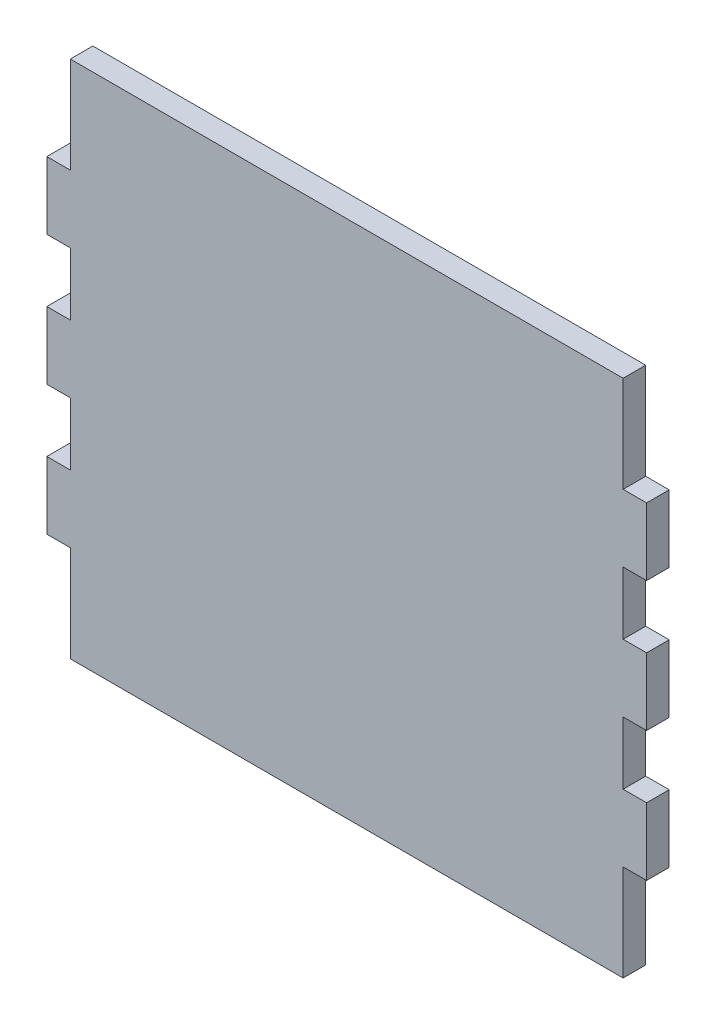
ISO-10303-21;
HEADER;
FILE_DESCRIPTION(('STEP AP214'),'2;1');
FILE_NAME('part.step','',(''),(''),'','','');
FILE_SCHEMA(('AUTOMOTIVE_DESIGN { 1 0 10303 214 1 1 1 1 }'));
ENDSEC;
DATA;
#1=APPLICATION_CONTEXT('core data for automotive mechanical design processes');
#2=APPLICATION_PROTOCOL_DEFINITION('international standard','automotive_design',2000,#1);
#3=PRODUCT_CONTEXT('',#1,'mechanical');
#4=PRODUCT('Part','Part','',(#3));
#5=PRODUCT_RELATED_PRODUCT_CATEGORY('part','',(#4));
#6=PRODUCT_DEFINITION_FORMATION('','',#4);
#7=PRODUCT_DEFINITION_CONTEXT('part definition',#1,'design');
#8=PRODUCT_DEFINITION('design','',#6,#7);
#9=PRODUCT_DEFINITION_SHAPE('','',#8);
#10=(LENGTH_UNIT() NAMED_UNIT(*) SI_UNIT(.MILLI.,.METRE.));
#11=(NAMED_UNIT(*) PLANE_ANGLE_UNIT() SI_UNIT($,.RADIAN.));
#12=(NAMED_UNIT(*) SI_UNIT($,.STERADIAN.) SOLID_ANGLE_UNIT());
#13=UNCERTAINTY_MEASURE_WITH_UNIT(LENGTH_MEASURE(1.E-05),#10,'distance_accuracy_value','');
#14=(GEOMETRIC_REPRESENTATION_CONTEXT(3) GLOBAL_UNCERTAINTY_ASSIGNED_CONTEXT((#13)) GLOBAL_UNIT_ASSIGNED_CONTEXT((#10,
#11,#12)) REPRESENTATION_CONTEXT('',''));
#15=CARTESIAN_POINT('',(0.,0.,0.));
#16=DIRECTION('',(0.,0.,1.));
#17=DIRECTION('',(1.,0.,0.));
#18=AXIS2_PLACEMENT_3D('',#15,#16,#17);
#19=CARTESIAN_POINT('',(-77.724,-45.974,3.175));
#20=DIRECTION('',(1.,0.,0.));
#21=DIRECTION('',(0.,0.,-1.));
#22=AXIS2_PLACEMENT_3D('',#19,#20,#21);
#23=PLANE('',#22);
#24=DIRECTION('',(0.,-1.,0.));
#25=VECTOR('',#24,1.);
#26=CARTESIAN_POINT('',(-77.724,-45.974,-3.175));
#27=LINE('',#26,#25);
#28=CARTESIAN_POINT('',(-77.724,-45.974,-3.175));
#29=VERTEX_POINT('',#28);
#30=CARTESIAN_POINT('',(-77.724,-73.025,-3.175));
#31=VERTEX_POINT('',#30);
#32=EDGE_CURVE('E248',#29,#31,#27,.T.);
#33=ORIENTED_EDGE('',*,*,#32,.T.);
#34=DIRECTION('',(0.,0.,-1.));
#35=VECTOR('',#34,1.);
#36=CARTESIAN_POINT('',(-77.724,-73.025,3.175));
#37=LINE('',#36,#35);
#38=CARTESIAN_POINT('',(-77.724,-73.025,3.175));
#39=VERTEX_POINT('',#38);
#40=EDGE_CURVE('E11',#39,#31,#37,.T.);
#41=ORIENTED_EDGE('',*,*,#40,.F.);
#42=DIRECTION('',(0.,-1.,0.));
#43=VECTOR('',#42,1.);
#44=CARTESIAN_POINT('',(-77.724,-45.974,3.175));
#45=LINE('',#44,#43);
#46=CARTESIAN_POINT('',(-77.724,-45.974,3.175));
#47=VERTEX_POINT('',#46);
#48=EDGE_CURVE('E302',#47,#39,#45,.T.);
#49=ORIENTED_EDGE('',*,*,#48,.F.);
#50=DIRECTION('',(0.,0.,-1.));
#51=VECTOR('',#50,1.);
#52=CARTESIAN_POINT('',(-77.724,-45.974,3.175));
#53=LINE('',#52,#51);
#54=EDGE_CURVE('E244',#47,#29,#53,.T.);
#55=ORIENTED_EDGE('',*,*,#54,.T.);
#56=EDGE_LOOP('',(#33,#41,#49,#55));
#57=FACE_BOUND('',#56,.T.);
#58=ADVANCED_FACE('F32',(#57),#23,.F.);
#59=CARTESIAN_POINT('',(77.724,-73.025,3.175));
#60=DIRECTION('',(0.,1.,0.));
#61=DIRECTION('',(0.,0.,1.));
#62=AXIS2_PLACEMENT_3D('',#59,#60,#61);
#63=PLANE('',#62);
#64=DIRECTION('',(1.,0.,0.));
#65=VECTOR('',#64,1.);
#66=CARTESIAN_POINT('',(77.724,-73.025,-3.175));
#67=LINE('',#66,#65);
#68=CARTESIAN_POINT('',(77.724,-73.025,-3.175));
#69=VERTEX_POINT('',#68);
#70=EDGE_CURVE('E251',#31,#69,#67,.T.);
#71=ORIENTED_EDGE('',*,*,#70,.T.);
#72=DIRECTION('',(0.,0.,-1.));
#73=VECTOR('',#72,1.);
#74=CARTESIAN_POINT('',(77.724,-73.025,3.175));
#75=LINE('',#74,#73);
#76=CARTESIAN_POINT('',(77.724,-73.025,3.175));
#77=VERTEX_POINT('',#76);
#78=EDGE_CURVE('E40',#77,#69,#75,.T.);
#79=ORIENTED_EDGE('',*,*,#78,.F.);
#80=DIRECTION('',(1.,0.,0.));
#81=VECTOR('',#80,1.);
#82=CARTESIAN_POINT('',(77.724,-73.025,3.175));
#83=LINE('',#82,#81);
#84=EDGE_CURVE('E151',#39,#77,#83,.T.);
#85=ORIENTED_EDGE('',*,*,#84,.F.);
#86=ORIENTED_EDGE('',*,*,#40,.T.);
#87=EDGE_LOOP('',(#71,#79,#85,#86));
#88=FACE_BOUND('',#87,.T.);
#89=ADVANCED_FACE('F460',(#88),#63,.F.);
#90=CARTESIAN_POINT('',(77.724,-45.974,3.175));
#91=DIRECTION('',(-1.,0.,0.));
#92=DIRECTION('',(0.,0.,1.));
#93=AXIS2_PLACEMENT_3D('',#90,#91,#92);
#94=PLANE('',#93);
#95=DIRECTION('',(0.,1.,0.));
#96=VECTOR('',#95,1.);
#97=CARTESIAN_POINT('',(77.724,-45.974,-3.175));
#98=LINE('',#97,#96);
#99=CARTESIAN_POINT('',(77.724,-45.974,-3.175));
#100=VERTEX_POINT('',#99);
#101=EDGE_CURVE('E253',#69,#100,#98,.T.);
#102=ORIENTED_EDGE('',*,*,#101,.T.);
#103=DIRECTION('',(0.,0.,-1.));
#104=VECTOR('',#103,1.);
#105=CARTESIAN_POINT('',(77.724,-45.974,3.175));
#106=LINE('',#105,#104);
#107=CARTESIAN_POINT('',(77.724,-45.974,3.175));
#108=VERTEX_POINT('',#107);
#109=EDGE_CURVE('E369',#108,#100,#106,.T.);
#110=ORIENTED_EDGE('',*,*,#109,.F.);
#111=DIRECTION('',(0.,1.,0.));
#112=VECTOR('',#111,1.);
#113=CARTESIAN_POINT('',(77.724,-45.974,3.175));
#114=LINE('',#113,#112);
#115=EDGE_CURVE('E377',#77,#108,#114,.T.);
#116=ORIENTED_EDGE('',*,*,#115,.F.);
#117=ORIENTED_EDGE('',*,*,#78,.T.);
#118=EDGE_LOOP('',(#102,#110,#116,#117));
#119=FACE_BOUND('',#118,.T.);
#120=ADVANCED_FACE('F375',(#119),#94,.F.);
#121=CARTESIAN_POINT('',(77.724,-45.974,3.175));
#122=DIRECTION('',(0.,1.,0.));
#123=DIRECTION('',(-1.,0.,0.));
#124=AXIS2_PLACEMENT_3D('',#121,#122,#123);
#125=PLANE('',#124);
#126=DIRECTION('',(1.,0.,0.));
#127=VECTOR('',#126,1.);
#128=CARTESIAN_POINT('',(77.724,-45.974,-3.175));
#129=LINE('',#128,#127);
#130=CARTESIAN_POINT('',(84.328,-45.974,-3.175));
#131=VERTEX_POINT('',#130);
#132=EDGE_CURVE('E255',#100,#131,#129,.T.);
#133=ORIENTED_EDGE('',*,*,#132,.T.);
#134=DIRECTION('',(0.,0.,-1.));
#135=VECTOR('',#134,1.);
#136=CARTESIAN_POINT('',(84.328,-45.974,3.175));
#137=LINE('',#136,#135);
#138=CARTESIAN_POINT('',(84.328,-45.974,3.175));
#139=VERTEX_POINT('',#138);
#140=EDGE_CURVE('E366',#139,#131,#137,.T.);
#141=ORIENTED_EDGE('',*,*,#140,.F.);
#142=DIRECTION('',(1.,0.,0.));
#143=VECTOR('',#142,1.);
#144=CARTESIAN_POINT('',(77.724,-45.974,3.175));
#145=LINE('',#144,#143);
#146=EDGE_CURVE('E395',#108,#139,#145,.T.);
#147=ORIENTED_EDGE('',*,*,#146,.F.);
#148=ORIENTED_EDGE('',*,*,#109,.T.);
#149=EDGE_LOOP('',(#133,#141,#147,#148));
#150=FACE_BOUND('',#149,.T.);
#151=ADVANCED_FACE('F386',(#150),#125,.F.);
#152=CARTESIAN_POINT('',(84.328,-27.051,3.175));
#153=DIRECTION('',(-1.,0.,0.));
#154=DIRECTION('',(0.,0.,1.));
#155=AXIS2_PLACEMENT_3D('',#152,#153,#154);
#156=PLANE('',#155);
#157=DIRECTION('',(0.,1.,0.));
#158=VECTOR('',#157,1.);
#159=CARTESIAN_POINT('',(84.328,-27.051,-3.175));
#160=LINE('',#159,#158);
#161=CARTESIAN_POINT('',(84.328,-27.051,-3.175));
#162=VERTEX_POINT('',#161);
#163=EDGE_CURVE('E257',#131,#162,#160,.T.);
#164=ORIENTED_EDGE('',*,*,#163,.T.);
#165=DIRECTION('',(0.,0.,-1.));
#166=VECTOR('',#165,1.);
#167=CARTESIAN_POINT('',(84.328,-27.051,3.175));
#168=LINE('',#167,#166);
#169=CARTESIAN_POINT('',(84.328,-27.051,3.175));
#170=VERTEX_POINT('',#169);
#171=EDGE_CURVE('E363',#170,#162,#168,.T.);
#172=ORIENTED_EDGE('',*,*,#171,.F.);
#173=DIRECTION('',(0.,1.,0.));
#174=VECTOR('',#173,1.);
#175=CARTESIAN_POINT('',(84.328,-27.051,3.175));
#176=LINE('',#175,#174);
#177=EDGE_CURVE('E392',#139,#170,#176,.T.);
#178=ORIENTED_EDGE('',*,*,#177,.F.);
#179=ORIENTED_EDGE('',*,*,#140,.T.);
#180=EDGE_LOOP('',(#164,#172,#178,#179));
#181=FACE_BOUND('',#180,.T.);
#182=ADVANCED_FACE('F390',(#181),#156,.F.);
#183=CARTESIAN_POINT('',(77.724,-27.051,3.175));
#184=DIRECTION('',(0.,-1.,0.));
#185=DIRECTION('',(1.,0.,0.));
#186=AXIS2_PLACEMENT_3D('',#183,#184,#185);
#187=PLANE('',#186);
#188=DIRECTION('',(-1.,0.,0.));
#189=VECTOR('',#188,1.);
#190=CARTESIAN_POINT('',(77.724,-27.051,-3.175));
#191=LINE('',#190,#189);
#192=CARTESIAN_POINT('',(77.724,-27.051,-3.175));
#193=VERTEX_POINT('',#192);
#194=EDGE_CURVE('E259',#162,#193,#191,.T.);
#195=ORIENTED_EDGE('',*,*,#194,.T.);
#196=DIRECTION('',(0.,0.,-1.));
#197=VECTOR('',#196,1.);
#198=CARTESIAN_POINT('',(77.724,-27.051,3.175));
#199=LINE('',#198,#197);
#200=CARTESIAN_POINT('',(77.724,-27.051,3.175));
#201=VERTEX_POINT('',#200);
#202=EDGE_CURVE('E360',#201,#193,#199,.T.);
#203=ORIENTED_EDGE('',*,*,#202,.F.);
#204=DIRECTION('',(-1.,0.,0.));
#205=VECTOR('',#204,1.);
#206=CARTESIAN_POINT('',(77.724,-27.051,3.175));
#207=LINE('',#206,#205);
#208=EDGE_CURVE('E394',#170,#201,#207,.T.);
#209=ORIENTED_EDGE('',*,*,#208,.F.);
#210=ORIENTED_EDGE('',*,*,#171,.T.);
#211=EDGE_LOOP('',(#195,#203,#209,#210));
#212=FACE_BOUND('',#211,.T.);
#213=ADVANCED_FACE('F473',(#212),#187,.F.);
#214=CARTESIAN_POINT('',(77.724,-9.46149999999997,3.175));
#215=DIRECTION('',(-1.,0.,0.));
#216=DIRECTION('',(0.,0.,1.));
#217=AXIS2_PLACEMENT_3D('',#214,#215,#216);
#218=PLANE('',#217);
#219=DIRECTION('',(0.,1.,0.));
#220=VECTOR('',#219,1.);
#221=CARTESIAN_POINT('',(77.724,-9.46149999999997,-3.175));
#222=LINE('',#221,#220);
#223=CARTESIAN_POINT('',(77.724,-9.46149999999997,-3.175));
#224=VERTEX_POINT('',#223);
#225=EDGE_CURVE('E261',#193,#224,#222,.T.);
#226=ORIENTED_EDGE('',*,*,#225,.T.);
#227=DIRECTION('',(0.,0.,-1.));
#228=VECTOR('',#227,1.);
#229=CARTESIAN_POINT('',(77.724,-9.46149999999997,3.175));
#230=LINE('',#229,#228);
#231=CARTESIAN_POINT('',(77.724,-9.46149999999997,3.175));
#232=VERTEX_POINT('',#231);
#233=EDGE_CURVE('E357',#232,#224,#230,.T.);
#234=ORIENTED_EDGE('',*,*,#233,.F.);
#235=DIRECTION('',(0.,1.,0.));
#236=VECTOR('',#235,1.);
#237=CARTESIAN_POINT('',(77.724,-9.46149999999997,3.175));
#238=LINE('',#237,#236);
#239=EDGE_CURVE('E397',#201,#232,#238,.T.);
#240=ORIENTED_EDGE('',*,*,#239,.F.);
#241=ORIENTED_EDGE('',*,*,#202,.T.);
#242=EDGE_LOOP('',(#226,#234,#240,#241));
#243=FACE_BOUND('',#242,.T.);
#244=ADVANCED_FACE('F476',(#243),#218,.F.);
#245=CARTESIAN_POINT('',(77.724,-9.46149999999997,3.175));
#246=DIRECTION('',(0.,1.,0.));
#247=DIRECTION('',(-1.,0.,0.));
#248=AXIS2_PLACEMENT_3D('',#245,#246,#247);
#249=PLANE('',#248);
#250=DIRECTION('',(1.,0.,0.));
#251=VECTOR('',#250,1.);
#252=CARTESIAN_POINT('',(77.724,-9.46149999999997,-3.175));
#253=LINE('',#252,#251);
#254=CARTESIAN_POINT('',(84.328,-9.46149999999997,-3.175));
#255=VERTEX_POINT('',#254);
#256=EDGE_CURVE('E263',#224,#255,#253,.T.);
#257=ORIENTED_EDGE('',*,*,#256,.T.);
#258=DIRECTION('',(0.,0.,-1.));
#259=VECTOR('',#258,1.);
#260=CARTESIAN_POINT('',(84.328,-9.46149999999997,3.175));
#261=LINE('',#260,#259);
#262=CARTESIAN_POINT('',(84.328,-9.46149999999997,3.175));
#263=VERTEX_POINT('',#262);
#264=EDGE_CURVE('E354',#263,#255,#261,.T.);
#265=ORIENTED_EDGE('',*,*,#264,.F.);
#266=DIRECTION('',(1.,0.,0.));
#267=VECTOR('',#266,1.);
#268=CARTESIAN_POINT('',(77.724,-9.46149999999997,3.175));
#269=LINE('',#268,#267);
#270=EDGE_CURVE('E403',#232,#263,#269,.T.);
#271=ORIENTED_EDGE('',*,*,#270,.F.);
#272=ORIENTED_EDGE('',*,*,#233,.T.);
#273=EDGE_LOOP('',(#257,#265,#271,#272));
#274=FACE_BOUND('',#273,.T.);
#275=ADVANCED_FACE('F480',(#274),#249,.F.);
#276=CARTESIAN_POINT('',(84.328,9.46149999999999,3.175));
#277=DIRECTION('',(-1.,0.,0.));
#278=DIRECTION('',(0.,0.,1.));
#279=AXIS2_PLACEMENT_3D('',#276,#277,#278);
#280=PLANE('',#279);
#281=DIRECTION('',(0.,1.,0.));
#282=VECTOR('',#281,1.);
#283=CARTESIAN_POINT('',(84.328,9.46149999999999,-3.175));
#284=LINE('',#283,#282);
#285=CARTESIAN_POINT('',(84.328,9.46149999999999,-3.175));
#286=VERTEX_POINT('',#285);
#287=EDGE_CURVE('E265',#255,#286,#284,.T.);
#288=ORIENTED_EDGE('',*,*,#287,.T.);
#289=DIRECTION('',(0.,0.,-1.));
#290=VECTOR('',#289,1.);
#291=CARTESIAN_POINT('',(84.328,9.46149999999999,3.175));
#292=LINE('',#291,#290);
#293=CARTESIAN_POINT('',(84.328,9.46149999999999,3.175));
#294=VERTEX_POINT('',#293);
#295=EDGE_CURVE('E351',#294,#286,#292,.T.);
#296=ORIENTED_EDGE('',*,*,#295,.F.);
#297=DIRECTION('',(0.,1.,0.));
#298=VECTOR('',#297,1.);
#299=CARTESIAN_POINT('',(84.328,9.46149999999999,3.175));
#300=LINE('',#299,#298);
#301=EDGE_CURVE('E405',#263,#294,#300,.T.);
#302=ORIENTED_EDGE('',*,*,#301,.F.);
#303=ORIENTED_EDGE('',*,*,#264,.T.);
#304=EDGE_LOOP('',(#288,#296,#302,#303));
#305=FACE_BOUND('',#304,.T.);
#306=ADVANCED_FACE('F484',(#305),#280,.F.);
#307=CARTESIAN_POINT('',(77.724,9.46149999999999,3.175));
#308=DIRECTION('',(0.,-1.,0.));
#309=DIRECTION('',(1.,0.,0.));
#310=AXIS2_PLACEMENT_3D('',#307,#308,#309);
#311=PLANE('',#310);
#312=DIRECTION('',(-1.,0.,0.));
#313=VECTOR('',#312,1.);
#314=CARTESIAN_POINT('',(77.724,9.46149999999999,-3.175));
#315=LINE('',#314,#313);
#316=CARTESIAN_POINT('',(77.724,9.46149999999999,-3.175));
#317=VERTEX_POINT('',#316);
#318=EDGE_CURVE('E267',#286,#317,#315,.T.);
#319=ORIENTED_EDGE('',*,*,#318,.T.);
#320=DIRECTION('',(0.,0.,-1.));
#321=VECTOR('',#320,1.);
#322=CARTESIAN_POINT('',(77.724,9.46149999999999,3.175));
#323=LINE('',#322,#321);
#324=CARTESIAN_POINT('',(77.724,9.46149999999999,3.175));
#325=VERTEX_POINT('',#324);
#326=EDGE_CURVE('E348',#325,#317,#323,.T.);
#327=ORIENTED_EDGE('',*,*,#326,.F.);
#328=DIRECTION('',(-1.,0.,0.));
#329=VECTOR('',#328,1.);
#330=CARTESIAN_POINT('',(77.724,9.46149999999999,3.175));
#331=LINE('',#330,#329);
#332=EDGE_CURVE('E407',#294,#325,#331,.T.);
#333=ORIENTED_EDGE('',*,*,#332,.F.);
#334=ORIENTED_EDGE('',*,*,#295,.T.);
#335=EDGE_LOOP('',(#319,#327,#333,#334));
#336=FACE_BOUND('',#335,.T.);
#337=ADVANCED_FACE('F488',(#336),#311,.F.);
#338=CARTESIAN_POINT('',(77.724,27.051,3.175));
#339=DIRECTION('',(-1.,0.,0.));
#340=DIRECTION('',(0.,0.,1.));
#341=AXIS2_PLACEMENT_3D('',#338,#339,#340);
#342=PLANE('',#341);
#343=DIRECTION('',(0.,1.,0.));
#344=VECTOR('',#343,1.);
#345=CARTESIAN_POINT('',(77.724,27.051,-3.175));
#346=LINE('',#345,#344);
#347=CARTESIAN_POINT('',(77.724,27.051,-3.175));
#348=VERTEX_POINT('',#347);
#349=EDGE_CURVE('E269',#317,#348,#346,.T.);
#350=ORIENTED_EDGE('',*,*,#349,.T.);
#351=DIRECTION('',(0.,0.,-1.));
#352=VECTOR('',#351,1.);
#353=CARTESIAN_POINT('',(77.724,27.051,3.175));
#354=LINE('',#353,#352);
#355=CARTESIAN_POINT('',(77.724,27.051,3.175));
#356=VERTEX_POINT('',#355);
#357=EDGE_CURVE('E345',#356,#348,#354,.T.);
#358=ORIENTED_EDGE('',*,*,#357,.F.);
#359=DIRECTION('',(0.,1.,0.));
#360=VECTOR('',#359,1.);
#361=CARTESIAN_POINT('',(77.724,27.051,3.175));
#362=LINE('',#361,#360);
#363=EDGE_CURVE('E409',#325,#356,#362,.T.);
#364=ORIENTED_EDGE('',*,*,#363,.F.);
#365=ORIENTED_EDGE('',*,*,#326,.T.);
#366=EDGE_LOOP('',(#350,#358,#364,#365));
#367=FACE_BOUND('',#366,.T.);
#368=ADVANCED_FACE('F492',(#367),#342,.F.);
#369=CARTESIAN_POINT('',(77.724,27.051,3.175));
#370=DIRECTION('',(0.,1.,0.));
#371=DIRECTION('',(0.,0.,1.));
#372=AXIS2_PLACEMENT_3D('',#369,#370,#371);
#373=PLANE('',#372);
#374=DIRECTION('',(1.,0.,0.));
#375=VECTOR('',#374,1.);
#376=CARTESIAN_POINT('',(77.724,27.051,-3.175));
#377=LINE('',#376,#375);
#378=CARTESIAN_POINT('',(84.328,27.051,-3.175));
#379=VERTEX_POINT('',#378);
#380=EDGE_CURVE('E271',#348,#379,#377,.T.);
#381=ORIENTED_EDGE('',*,*,#380,.T.);
#382=DIRECTION('',(0.,0.,-1.));
#383=VECTOR('',#382,1.);
#384=CARTESIAN_POINT('',(84.328,27.051,3.175));
#385=LINE('',#384,#383);
#386=CARTESIAN_POINT('',(84.328,27.051,3.175));
#387=VERTEX_POINT('',#386);
#388=EDGE_CURVE('E342',#387,#379,#385,.T.);
#389=ORIENTED_EDGE('',*,*,#388,.F.);
#390=DIRECTION('',(1.,0.,0.));
#391=VECTOR('',#390,1.);
#392=CARTESIAN_POINT('',(77.724,27.051,3.175));
#393=LINE('',#392,#391);
#394=EDGE_CURVE('E411',#356,#387,#393,.T.);
#395=ORIENTED_EDGE('',*,*,#394,.F.);
#396=ORIENTED_EDGE('',*,*,#357,.T.);
#397=EDGE_LOOP('',(#381,#389,#395,#396));
#398=FACE_BOUND('',#397,.T.);
#399=ADVANCED_FACE('F496',(#398),#373,.F.);
#400=CARTESIAN_POINT('',(84.328,45.974,3.175));
#401=DIRECTION('',(-1.,0.,0.));
#402=DIRECTION('',(0.,0.,1.));
#403=AXIS2_PLACEMENT_3D('',#400,#401,#402);
#404=PLANE('',#403);
#405=DIRECTION('',(0.,1.,0.));
#406=VECTOR('',#405,1.);
#407=CARTESIAN_POINT('',(84.328,45.974,-3.175));
#408=LINE('',#407,#406);
#409=CARTESIAN_POINT('',(84.328,45.974,-3.175));
#410=VERTEX_POINT('',#409);
#411=EDGE_CURVE('E273',#379,#410,#408,.T.);
#412=ORIENTED_EDGE('',*,*,#411,.T.);
#413=DIRECTION('',(0.,0.,-1.));
#414=VECTOR('',#413,1.);
#415=CARTESIAN_POINT('',(84.328,45.974,3.175));
#416=LINE('',#415,#414);
#417=CARTESIAN_POINT('',(84.328,45.974,3.175));
#418=VERTEX_POINT('',#417);
#419=EDGE_CURVE('E339',#418,#410,#416,.T.);
#420=ORIENTED_EDGE('',*,*,#419,.F.);
#421=DIRECTION('',(0.,1.,0.));
#422=VECTOR('',#421,1.);
#423=CARTESIAN_POINT('',(84.328,45.974,3.175));
#424=LINE('',#423,#422);
#425=EDGE_CURVE('E413',#387,#418,#424,.T.);
#426=ORIENTED_EDGE('',*,*,#425,.F.);
#427=ORIENTED_EDGE('',*,*,#388,.T.);
#428=EDGE_LOOP('',(#412,#420,#426,#427));
#429=FACE_BOUND('',#428,.T.);
#430=ADVANCED_FACE('F500',(#429),#404,.F.);
#431=CARTESIAN_POINT('',(77.724,45.974,3.175));
#432=DIRECTION('',(0.,-1.,0.));
#433=DIRECTION('',(0.,0.,-1.));
#434=AXIS2_PLACEMENT_3D('',#431,#432,#433);
#435=PLANE('',#434);
#436=DIRECTION('',(-1.,0.,0.));
#437=VECTOR('',#436,1.);
#438=CARTESIAN_POINT('',(77.724,45.974,-3.175));
#439=LINE('',#438,#437);
#440=CARTESIAN_POINT('',(77.724,45.974,-3.175));
#441=VERTEX_POINT('',#440);
#442=EDGE_CURVE('E275',#410,#441,#439,.T.);
#443=ORIENTED_EDGE('',*,*,#442,.T.);
#444=DIRECTION('',(0.,0.,-1.));
#445=VECTOR('',#444,1.);
#446=CARTESIAN_POINT('',(77.724,45.974,3.175));
#447=LINE('',#446,#445);
#448=CARTESIAN_POINT('',(77.724,45.974,3.175));
#449=VERTEX_POINT('',#448);
#450=EDGE_CURVE('E336',#449,#441,#447,.T.);
#451=ORIENTED_EDGE('',*,*,#450,.F.);
#452=DIRECTION('',(-1.,0.,0.));
#453=VECTOR('',#452,1.);
#454=CARTESIAN_POINT('',(77.724,45.974,3.175));
#455=LINE('',#454,#453);
#456=EDGE_CURVE('E415',#418,#449,#455,.T.);
#457=ORIENTED_EDGE('',*,*,#456,.F.);
#458=ORIENTED_EDGE('',*,*,#419,.T.);
#459=EDGE_LOOP('',(#443,#451,#457,#458));
#460=FACE_BOUND('',#459,.T.);
#461=ADVANCED_FACE('F504',(#460),#435,.F.);
#462=CARTESIAN_POINT('',(77.724,73.025,3.175));
#463=DIRECTION('',(-1.,0.,0.));
#464=DIRECTION('',(0.,0.,1.));
#465=AXIS2_PLACEMENT_3D('',#462,#463,#464);
#466=PLANE('',#465);
#467=DIRECTION('',(0.,1.,0.));
#468=VECTOR('',#467,1.);
#469=CARTESIAN_POINT('',(77.724,73.025,-3.175));
#470=LINE('',#469,#468);
#471=CARTESIAN_POINT('',(77.724,73.025,-3.175));
#472=VERTEX_POINT('',#471);
#473=EDGE_CURVE('E277',#441,#472,#470,.T.);
#474=ORIENTED_EDGE('',*,*,#473,.T.);
#475=DIRECTION('',(0.,0.,-1.));
#476=VECTOR('',#475,1.);
#477=CARTESIAN_POINT('',(77.724,73.025,3.175));
#478=LINE('',#477,#476);
#479=CARTESIAN_POINT('',(77.724,73.025,3.175));
#480=VERTEX_POINT('',#479);
#481=EDGE_CURVE('E333',#480,#472,#478,.T.);
#482=ORIENTED_EDGE('',*,*,#481,.F.);
#483=DIRECTION('',(0.,1.,0.));
#484=VECTOR('',#483,1.);
#485=CARTESIAN_POINT('',(77.724,73.025,3.175));
#486=LINE('',#485,#484);
#487=EDGE_CURVE('E417',#449,#480,#486,.T.);
#488=ORIENTED_EDGE('',*,*,#487,.F.);
#489=ORIENTED_EDGE('',*,*,#450,.T.);
#490=EDGE_LOOP('',(#474,#482,#488,#489));
#491=FACE_BOUND('',#490,.T.);
#492=ADVANCED_FACE('F508',(#491),#466,.F.);
#493=CARTESIAN_POINT('',(77.724,73.025,3.175));
#494=DIRECTION('',(0.,-1.,0.));
#495=DIRECTION('',(0.,0.,-1.));
#496=AXIS2_PLACEMENT_3D('',#493,#494,#495);
#497=PLANE('',#496);
#498=DIRECTION('',(-1.,0.,0.));
#499=VECTOR('',#498,1.);
#500=CARTESIAN_POINT('',(77.724,73.025,-3.175));
#501=LINE('',#500,#499);
#502=CARTESIAN_POINT('',(-77.724,73.025,-3.175));
#503=VERTEX_POINT('',#502);
#504=EDGE_CURVE('E279',#472,#503,#501,.T.);
#505=ORIENTED_EDGE('',*,*,#504,.T.);
#506=DIRECTION('',(0.,0.,-1.));
#507=VECTOR('',#506,1.);
#508=CARTESIAN_POINT('',(-77.724,73.025,3.175));
#509=LINE('',#508,#507);
#510=CARTESIAN_POINT('',(-77.724,73.025,3.175));
#511=VERTEX_POINT('',#510);
#512=EDGE_CURVE('E330',#511,#503,#509,.T.);
#513=ORIENTED_EDGE('',*,*,#512,.F.);
#514=DIRECTION('',(-1.,0.,0.));
#515=VECTOR('',#514,1.);
#516=CARTESIAN_POINT('',(77.724,73.025,3.175));
#517=LINE('',#516,#515);
#518=EDGE_CURVE('E419',#480,#511,#517,.T.);
#519=ORIENTED_EDGE('',*,*,#518,.F.);
#520=ORIENTED_EDGE('',*,*,#481,.T.);
#521=EDGE_LOOP('',(#505,#513,#519,#520));
#522=FACE_BOUND('',#521,.T.);
#523=ADVANCED_FACE('F512',(#522),#497,.F.);
#524=CARTESIAN_POINT('',(-77.724,73.025,3.175));
#525=DIRECTION('',(1.,0.,0.));
#526=DIRECTION('',(0.,0.,-1.));
#527=AXIS2_PLACEMENT_3D('',#524,#525,#526);
#528=PLANE('',#527);
#529=DIRECTION('',(0.,-1.,0.));
#530=VECTOR('',#529,1.);
#531=CARTESIAN_POINT('',(-77.724,73.025,-3.175));
#532=LINE('',#531,#530);
#533=CARTESIAN_POINT('',(-77.724,45.974,-3.175));
#534=VERTEX_POINT('',#533);
#535=EDGE_CURVE('E281',#503,#534,#532,.T.);
#536=ORIENTED_EDGE('',*,*,#535,.T.);
#537=DIRECTION('',(0.,0.,-1.));
#538=VECTOR('',#537,1.);
#539=CARTESIAN_POINT('',(-77.724,45.974,3.175));
#540=LINE('',#539,#538);
#541=CARTESIAN_POINT('',(-77.724,45.974,3.175));
#542=VERTEX_POINT('',#541);
#543=EDGE_CURVE('E327',#542,#534,#540,.T.);
#544=ORIENTED_EDGE('',*,*,#543,.F.);
#545=DIRECTION('',(0.,-1.,0.));
#546=VECTOR('',#545,1.);
#547=CARTESIAN_POINT('',(-77.724,73.025,3.175));
#548=LINE('',#547,#546);
#549=EDGE_CURVE('E421',#511,#542,#548,.T.);
#550=ORIENTED_EDGE('',*,*,#549,.F.);
#551=ORIENTED_EDGE('',*,*,#512,.T.);
#552=EDGE_LOOP('',(#536,#544,#550,#551));
#553=FACE_BOUND('',#552,.T.);
#554=ADVANCED_FACE('F516',(#553),#528,.F.);
#555=CARTESIAN_POINT('',(-77.724,45.974,3.175));
#556=DIRECTION('',(0.,-1.,0.));
#557=DIRECTION('',(0.,0.,-1.));
#558=AXIS2_PLACEMENT_3D('',#555,#556,#557);
#559=PLANE('',#558);
#560=DIRECTION('',(-1.,0.,0.));
#561=VECTOR('',#560,1.);
#562=CARTESIAN_POINT('',(-77.724,45.974,-3.175));
#563=LINE('',#562,#561);
#564=CARTESIAN_POINT('',(-84.328,45.974,-3.175));
#565=VERTEX_POINT('',#564);
#566=EDGE_CURVE('E283',#534,#565,#563,.T.);
#567=ORIENTED_EDGE('',*,*,#566,.T.);
#568=DIRECTION('',(0.,0.,-1.));
#569=VECTOR('',#568,1.);
#570=CARTESIAN_POINT('',(-84.328,45.974,3.175));
#571=LINE('',#570,#569);
#572=CARTESIAN_POINT('',(-84.328,45.974,3.175));
#573=VERTEX_POINT('',#572);
#574=EDGE_CURVE('E324',#573,#565,#571,.T.);
#575=ORIENTED_EDGE('',*,*,#574,.F.);
#576=DIRECTION('',(-1.,0.,0.));
#577=VECTOR('',#576,1.);
#578=CARTESIAN_POINT('',(-77.724,45.974,3.175));
#579=LINE('',#578,#577);
#580=EDGE_CURVE('E423',#542,#573,#579,.T.);
#581=ORIENTED_EDGE('',*,*,#580,.F.);
#582=ORIENTED_EDGE('',*,*,#543,.T.);
#583=EDGE_LOOP('',(#567,#575,#581,#582));
#584=FACE_BOUND('',#583,.T.);
#585=ADVANCED_FACE('F520',(#584),#559,.F.);
#586=CARTESIAN_POINT('',(-84.328,45.974,3.175));
#587=DIRECTION('',(1.,0.,0.));
#588=DIRECTION('',(0.,0.,-1.));
#589=AXIS2_PLACEMENT_3D('',#586,#587,#588);
#590=PLANE('',#589);
#591=DIRECTION('',(0.,-1.,0.));
#592=VECTOR('',#591,1.);
#593=CARTESIAN_POINT('',(-84.328,45.974,-3.175));
#594=LINE('',#593,#592);
#595=CARTESIAN_POINT('',(-84.328,27.051,-3.175));
#596=VERTEX_POINT('',#595);
#597=EDGE_CURVE('E285',#565,#596,#594,.T.);
#598=ORIENTED_EDGE('',*,*,#597,.T.);
#599=DIRECTION('',(0.,0.,-1.));
#600=VECTOR('',#599,1.);
#601=CARTESIAN_POINT('',(-84.328,27.051,3.175));
#602=LINE('',#601,#600);
#603=CARTESIAN_POINT('',(-84.328,27.051,3.175));
#604=VERTEX_POINT('',#603);
#605=EDGE_CURVE('E321',#604,#596,#602,.T.);
#606=ORIENTED_EDGE('',*,*,#605,.F.);
#607=DIRECTION('',(0.,-1.,0.));
#608=VECTOR('',#607,1.);
#609=CARTESIAN_POINT('',(-84.328,45.974,3.175));
#610=LINE('',#609,#608);
#611=EDGE_CURVE('E425',#573,#604,#610,.T.);
#612=ORIENTED_EDGE('',*,*,#611,.F.);
#613=ORIENTED_EDGE('',*,*,#574,.T.);
#614=EDGE_LOOP('',(#598,#606,#612,#613));
#615=FACE_BOUND('',#614,.T.);
#616=ADVANCED_FACE('F524',(#615),#590,.F.);
#617=CARTESIAN_POINT('',(-77.724,27.051,3.175));
#618=DIRECTION('',(0.,1.,0.));
#619=DIRECTION('',(0.,0.,1.));
#620=AXIS2_PLACEMENT_3D('',#617,#618,#619);
#621=PLANE('',#620);
#622=DIRECTION('',(1.,0.,0.));
#623=VECTOR('',#622,1.);
#624=CARTESIAN_POINT('',(-77.724,27.051,-3.175));
#625=LINE('',#624,#623);
#626=CARTESIAN_POINT('',(-77.724,27.051,-3.175));
#627=VERTEX_POINT('',#626);
#628=EDGE_CURVE('E287',#596,#627,#625,.T.);
#629=ORIENTED_EDGE('',*,*,#628,.T.);
#630=DIRECTION('',(0.,0.,-1.));
#631=VECTOR('',#630,1.);
#632=CARTESIAN_POINT('',(-77.724,27.051,3.175));
#633=LINE('',#632,#631);
#634=CARTESIAN_POINT('',(-77.724,27.051,3.175));
#635=VERTEX_POINT('',#634);
#636=EDGE_CURVE('E318',#635,#627,#633,.T.);
#637=ORIENTED_EDGE('',*,*,#636,.F.);
#638=DIRECTION('',(1.,0.,0.));
#639=VECTOR('',#638,1.);
#640=CARTESIAN_POINT('',(-77.724,27.051,3.175));
#641=LINE('',#640,#639);
#642=EDGE_CURVE('E427',#604,#635,#641,.T.);
#643=ORIENTED_EDGE('',*,*,#642,.F.);
#644=ORIENTED_EDGE('',*,*,#605,.T.);
#645=EDGE_LOOP('',(#629,#637,#643,#644));
#646=FACE_BOUND('',#645,.T.);
#647=ADVANCED_FACE('F528',(#646),#621,.F.);
#648=CARTESIAN_POINT('',(-77.724,27.051,3.175));
#649=DIRECTION('',(1.,0.,0.));
#650=DIRECTION('',(0.,0.,-1.));
#651=AXIS2_PLACEMENT_3D('',#648,#649,#650);
#652=PLANE('',#651);
#653=DIRECTION('',(0.,-1.,0.));
#654=VECTOR('',#653,1.);
#655=CARTESIAN_POINT('',(-77.724,27.051,-3.175));
#656=LINE('',#655,#654);
#657=CARTESIAN_POINT('',(-77.724,9.46149999999999,-3.175));
#658=VERTEX_POINT('',#657);
#659=EDGE_CURVE('E289',#627,#658,#656,.T.);
#660=ORIENTED_EDGE('',*,*,#659,.T.);
#661=DIRECTION('',(0.,0.,-1.));
#662=VECTOR('',#661,1.);
#663=CARTESIAN_POINT('',(-77.724,9.46149999999999,3.175));
#664=LINE('',#663,#662);
#665=CARTESIAN_POINT('',(-77.724,9.46149999999999,3.175));
#666=VERTEX_POINT('',#665);
#667=EDGE_CURVE('E315',#666,#658,#664,.T.);
#668=ORIENTED_EDGE('',*,*,#667,.F.);
#669=DIRECTION('',(0.,-1.,0.));
#670=VECTOR('',#669,1.);
#671=CARTESIAN_POINT('',(-77.724,27.051,3.175));
#672=LINE('',#671,#670);
#673=EDGE_CURVE('E429',#635,#666,#672,.T.);
#674=ORIENTED_EDGE('',*,*,#673,.F.);
#675=ORIENTED_EDGE('',*,*,#636,.T.);
#676=EDGE_LOOP('',(#660,#668,#674,#675));
#677=FACE_BOUND('',#676,.T.);
#678=ADVANCED_FACE('F532',(#677),#652,.F.);
#679=CARTESIAN_POINT('',(-77.724,9.46149999999999,3.175));
#680=DIRECTION('',(0.,-1.,0.));
#681=DIRECTION('',(1.,0.,0.));
#682=AXIS2_PLACEMENT_3D('',#679,#680,#681);
#683=PLANE('',#682);
#684=DIRECTION('',(-1.,0.,0.));
#685=VECTOR('',#684,1.);
#686=CARTESIAN_POINT('',(-77.724,9.46149999999999,-3.175));
#687=LINE('',#686,#685);
#688=CARTESIAN_POINT('',(-84.328,9.46149999999999,-3.175));
#689=VERTEX_POINT('',#688);
#690=EDGE_CURVE('E291',#658,#689,#687,.T.);
#691=ORIENTED_EDGE('',*,*,#690,.T.);
#692=DIRECTION('',(0.,0.,-1.));
#693=VECTOR('',#692,1.);
#694=CARTESIAN_POINT('',(-84.328,9.46149999999999,3.175));
#695=LINE('',#694,#693);
#696=CARTESIAN_POINT('',(-84.328,9.46149999999999,3.175));
#697=VERTEX_POINT('',#696);
#698=EDGE_CURVE('E312',#697,#689,#695,.T.);
#699=ORIENTED_EDGE('',*,*,#698,.F.);
#700=DIRECTION('',(-1.,0.,0.));
#701=VECTOR('',#700,1.);
#702=CARTESIAN_POINT('',(-77.724,9.46149999999999,3.175));
#703=LINE('',#702,#701);
#704=EDGE_CURVE('E431',#666,#697,#703,.T.);
#705=ORIENTED_EDGE('',*,*,#704,.F.);
#706=ORIENTED_EDGE('',*,*,#667,.T.);
#707=EDGE_LOOP('',(#691,#699,#705,#706));
#708=FACE_BOUND('',#707,.T.);
#709=ADVANCED_FACE('F536',(#708),#683,.F.);
#710=CARTESIAN_POINT('',(-84.328,9.46149999999999,3.175));
#711=DIRECTION('',(1.,0.,0.));
#712=DIRECTION('',(0.,0.,-1.));
#713=AXIS2_PLACEMENT_3D('',#710,#711,#712);
#714=PLANE('',#713);
#715=DIRECTION('',(0.,-1.,0.));
#716=VECTOR('',#715,1.);
#717=CARTESIAN_POINT('',(-84.328,9.46149999999999,-3.175));
#718=LINE('',#717,#716);
#719=CARTESIAN_POINT('',(-84.328,-9.46150000000001,-3.175));
#720=VERTEX_POINT('',#719);
#721=EDGE_CURVE('E293',#689,#720,#718,.T.);
#722=ORIENTED_EDGE('',*,*,#721,.T.);
#723=DIRECTION('',(0.,0.,-1.));
#724=VECTOR('',#723,1.);
#725=CARTESIAN_POINT('',(-84.328,-9.46150000000001,3.175));
#726=LINE('',#725,#724);
#727=CARTESIAN_POINT('',(-84.328,-9.46150000000001,3.175));
#728=VERTEX_POINT('',#727);
#729=EDGE_CURVE('E309',#728,#720,#726,.T.);
#730=ORIENTED_EDGE('',*,*,#729,.F.);
#731=DIRECTION('',(0.,-1.,0.));
#732=VECTOR('',#731,1.);
#733=CARTESIAN_POINT('',(-84.328,9.46149999999999,3.175));
#734=LINE('',#733,#732);
#735=EDGE_CURVE('E433',#697,#728,#734,.T.);
#736=ORIENTED_EDGE('',*,*,#735,.F.);
#737=ORIENTED_EDGE('',*,*,#698,.T.);
#738=EDGE_LOOP('',(#722,#730,#736,#737));
#739=FACE_BOUND('',#738,.T.);
#740=ADVANCED_FACE('F540',(#739),#714,.F.);
#741=CARTESIAN_POINT('',(-77.724,-9.46150000000001,3.175));
#742=DIRECTION('',(0.,1.,0.));
#743=DIRECTION('',(0.,0.,1.));
#744=AXIS2_PLACEMENT_3D('',#741,#742,#743);
#745=PLANE('',#744);
#746=DIRECTION('',(1.,0.,0.));
#747=VECTOR('',#746,1.);
#748=CARTESIAN_POINT('',(-77.724,-9.46150000000001,-3.175));
#749=LINE('',#748,#747);
#750=CARTESIAN_POINT('',(-77.724,-9.46150000000001,-3.175));
#751=VERTEX_POINT('',#750);
#752=EDGE_CURVE('E295',#720,#751,#749,.T.);
#753=ORIENTED_EDGE('',*,*,#752,.T.);
#754=DIRECTION('',(0.,0.,-1.));
#755=VECTOR('',#754,1.);
#756=CARTESIAN_POINT('',(-77.724,-9.46150000000001,3.175));
#757=LINE('',#756,#755);
#758=CARTESIAN_POINT('',(-77.724,-9.46150000000001,3.175));
#759=VERTEX_POINT('',#758);
#760=EDGE_CURVE('E306',#759,#751,#757,.T.);
#761=ORIENTED_EDGE('',*,*,#760,.F.);
#762=DIRECTION('',(1.,0.,0.));
#763=VECTOR('',#762,1.);
#764=CARTESIAN_POINT('',(-77.724,-9.46150000000001,3.175));
#765=LINE('',#764,#763);
#766=EDGE_CURVE('E435',#728,#759,#765,.T.);
#767=ORIENTED_EDGE('',*,*,#766,.F.);
#768=ORIENTED_EDGE('',*,*,#729,.T.);
#769=EDGE_LOOP('',(#753,#761,#767,#768));
#770=FACE_BOUND('',#769,.T.);
#771=ADVANCED_FACE('F441',(#770),#745,.F.);
#772=CARTESIAN_POINT('',(-77.724,-9.46150000000001,3.175));
#773=DIRECTION('',(1.,0.,0.));
#774=DIRECTION('',(0.,0.,-1.));
#775=AXIS2_PLACEMENT_3D('',#772,#773,#774);
#776=PLANE('',#775);
#777=DIRECTION('',(0.,-1.,0.));
#778=VECTOR('',#777,1.);
#779=CARTESIAN_POINT('',(-77.724,-9.46150000000001,-3.175));
#780=LINE('',#779,#778);
#781=CARTESIAN_POINT('',(-77.724,-27.051,-3.175));
#782=VERTEX_POINT('',#781);
#783=EDGE_CURVE('E297',#751,#782,#780,.T.);
#784=ORIENTED_EDGE('',*,*,#783,.T.);
#785=DIRECTION('',(0.,0.,-1.));
#786=VECTOR('',#785,1.);
#787=CARTESIAN_POINT('',(-77.724,-27.051,3.175));
#788=LINE('',#787,#786);
#789=CARTESIAN_POINT('',(-77.724,-27.051,3.175));
#790=VERTEX_POINT('',#789);
#791=EDGE_CURVE('E239',#790,#782,#788,.T.);
#792=ORIENTED_EDGE('',*,*,#791,.F.);
#793=DIRECTION('',(0.,-1.,0.));
#794=VECTOR('',#793,1.);
#795=CARTESIAN_POINT('',(-77.724,-9.46150000000001,3.175));
#796=LINE('',#795,#794);
#797=EDGE_CURVE('E230',#759,#790,#796,.T.);
#798=ORIENTED_EDGE('',*,*,#797,.F.);
#799=ORIENTED_EDGE('',*,*,#760,.T.);
#800=EDGE_LOOP('',(#784,#792,#798,#799));
#801=FACE_BOUND('',#800,.T.);
#802=ADVANCED_FACE('F445',(#801),#776,.F.);
#803=CARTESIAN_POINT('',(-77.724,-27.051,3.175));
#804=DIRECTION('',(0.,-1.,0.));
#805=DIRECTION('',(1.,0.,0.));
#806=AXIS2_PLACEMENT_3D('',#803,#804,#805);
#807=PLANE('',#806);
#808=DIRECTION('',(-1.,0.,0.));
#809=VECTOR('',#808,1.);
#810=CARTESIAN_POINT('',(-77.724,-27.051,-3.175));
#811=LINE('',#810,#809);
#812=CARTESIAN_POINT('',(-84.328,-27.051,-3.175));
#813=VERTEX_POINT('',#812);
#814=EDGE_CURVE('E238',#782,#813,#811,.T.);
#815=ORIENTED_EDGE('',*,*,#814,.T.);
#816=DIRECTION('',(0.,0.,-1.));
#817=VECTOR('',#816,1.);
#818=CARTESIAN_POINT('',(-84.328,-27.051,3.175));
#819=LINE('',#818,#817);
#820=CARTESIAN_POINT('',(-84.328,-27.051,3.175));
#821=VERTEX_POINT('',#820);
#822=EDGE_CURVE('E235',#821,#813,#819,.T.);
#823=ORIENTED_EDGE('',*,*,#822,.F.);
#824=DIRECTION('',(-1.,0.,0.));
#825=VECTOR('',#824,1.);
#826=CARTESIAN_POINT('',(-77.724,-27.051,3.175));
#827=LINE('',#826,#825);
#828=EDGE_CURVE('E224',#790,#821,#827,.T.);
#829=ORIENTED_EDGE('',*,*,#828,.F.);
#830=ORIENTED_EDGE('',*,*,#791,.T.);
#831=EDGE_LOOP('',(#815,#823,#829,#830));
#832=FACE_BOUND('',#831,.T.);
#833=ADVANCED_FACE('F236',(#832),#807,.F.);
#834=CARTESIAN_POINT('',(-84.328,-27.051,3.175));
#835=DIRECTION('',(1.,0.,0.));
#836=DIRECTION('',(0.,0.,-1.));
#837=AXIS2_PLACEMENT_3D('',#834,#835,#836);
#838=PLANE('',#837);
#839=DIRECTION('',(0.,-1.,0.));
#840=VECTOR('',#839,1.);
#841=CARTESIAN_POINT('',(-84.328,-27.051,-3.175));
#842=LINE('',#841,#840);
#843=CARTESIAN_POINT('',(-84.328,-45.974,-3.175));
#844=VERTEX_POINT('',#843);
#845=EDGE_CURVE('E137',#813,#844,#842,.T.);
#846=ORIENTED_EDGE('',*,*,#845,.T.);
#847=DIRECTION('',(0.,0.,-1.));
#848=VECTOR('',#847,1.);
#849=CARTESIAN_POINT('',(-84.328,-45.974,3.175));
#850=LINE('',#849,#848);
#851=CARTESIAN_POINT('',(-84.328,-45.974,3.175));
#852=VERTEX_POINT('',#851);
#853=EDGE_CURVE('E240',#852,#844,#850,.T.);
#854=ORIENTED_EDGE('',*,*,#853,.F.);
#855=DIRECTION('',(0.,-1.,0.));
#856=VECTOR('',#855,1.);
#857=CARTESIAN_POINT('',(-84.328,-27.051,3.175));
#858=LINE('',#857,#856);
#859=EDGE_CURVE('E228',#821,#852,#858,.T.);
#860=ORIENTED_EDGE('',*,*,#859,.F.);
#861=ORIENTED_EDGE('',*,*,#822,.T.);
#862=EDGE_LOOP('',(#846,#854,#860,#861));
#863=FACE_BOUND('',#862,.T.);
#864=ADVANCED_FACE('F242',(#863),#838,.F.);
#865=CARTESIAN_POINT('',(-77.724,-45.974,3.175));
#866=DIRECTION('',(0.,1.,0.));
#867=DIRECTION('',(-1.,0.,0.));
#868=AXIS2_PLACEMENT_3D('',#865,#866,#867);
#869=PLANE('',#868);
#870=DIRECTION('',(1.,0.,0.));
#871=VECTOR('',#870,1.);
#872=CARTESIAN_POINT('',(-77.724,-45.974,-3.175));
#873=LINE('',#872,#871);
#874=EDGE_CURVE('E143',#844,#29,#873,.T.);
#875=ORIENTED_EDGE('',*,*,#874,.T.);
#876=ORIENTED_EDGE('',*,*,#54,.F.);
#877=DIRECTION('',(1.,0.,0.));
#878=VECTOR('',#877,1.);
#879=CARTESIAN_POINT('',(-77.724,-45.974,3.175));
#880=LINE('',#879,#878);
#881=EDGE_CURVE('E48',#852,#47,#880,.T.);
#882=ORIENTED_EDGE('',*,*,#881,.F.);
#883=ORIENTED_EDGE('',*,*,#853,.T.);
#884=EDGE_LOOP('',(#875,#876,#882,#883));
#885=FACE_BOUND('',#884,.T.);
#886=ADVANCED_FACE('F449',(#885),#869,.F.);
#887=CARTESIAN_POINT('',(0.,0.,3.175));
#888=DIRECTION('',(0.,0.,-1.));
#889=DIRECTION('',(-1.,0.,0.));
#890=AXIS2_PLACEMENT_3D('',#887,#888,#889);
#891=PLANE('',#890);
#892=ORIENTED_EDGE('',*,*,#48,.T.);
#893=ORIENTED_EDGE('',*,*,#84,.T.);
#894=ORIENTED_EDGE('',*,*,#115,.T.);
#895=ORIENTED_EDGE('',*,*,#146,.T.);
#896=ORIENTED_EDGE('',*,*,#177,.T.);
#897=ORIENTED_EDGE('',*,*,#208,.T.);
#898=ORIENTED_EDGE('',*,*,#239,.T.);
#899=ORIENTED_EDGE('',*,*,#270,.T.);
#900=ORIENTED_EDGE('',*,*,#301,.T.);
#901=ORIENTED_EDGE('',*,*,#332,.T.);
#902=ORIENTED_EDGE('',*,*,#363,.T.);
#903=ORIENTED_EDGE('',*,*,#394,.T.);
#904=ORIENTED_EDGE('',*,*,#425,.T.);
#905=ORIENTED_EDGE('',*,*,#456,.T.);
#906=ORIENTED_EDGE('',*,*,#487,.T.);
#907=ORIENTED_EDGE('',*,*,#518,.T.);
#908=ORIENTED_EDGE('',*,*,#549,.T.);
#909=ORIENTED_EDGE('',*,*,#580,.T.);
#910=ORIENTED_EDGE('',*,*,#611,.T.);
#911=ORIENTED_EDGE('',*,*,#642,.T.);
#912=ORIENTED_EDGE('',*,*,#673,.T.);
#913=ORIENTED_EDGE('',*,*,#704,.T.);
#914=ORIENTED_EDGE('',*,*,#735,.T.);
#915=ORIENTED_EDGE('',*,*,#766,.T.);
#916=ORIENTED_EDGE('',*,*,#797,.T.);
#917=ORIENTED_EDGE('',*,*,#828,.T.);
#918=ORIENTED_EDGE('',*,*,#859,.T.);
#919=ORIENTED_EDGE('',*,*,#881,.T.);
#920=EDGE_LOOP('',(#892,#893,#894,#895,#896,#897,#898,#899,#900,#901,#902,#903,#904,#905,#906,
#907,#908,#909,#910,#911,#912,#913,#914,#915,#916,#917,#918,#919));
#921=FACE_BOUND('',#920,.T.);
#922=ADVANCED_FACE('F226',(#921),#891,.F.);
#923=CARTESIAN_POINT('',(0.,0.,-3.175));
#924=DIRECTION('',(0.,0.,-1.));
#925=DIRECTION('',(-1.,0.,0.));
#926=AXIS2_PLACEMENT_3D('',#923,#924,#925);
#927=PLANE('',#926);
#928=ORIENTED_EDGE('',*,*,#32,.F.);
#929=ORIENTED_EDGE('',*,*,#874,.F.);
#930=ORIENTED_EDGE('',*,*,#845,.F.);
#931=ORIENTED_EDGE('',*,*,#814,.F.);
#932=ORIENTED_EDGE('',*,*,#783,.F.);
#933=ORIENTED_EDGE('',*,*,#752,.F.);
#934=ORIENTED_EDGE('',*,*,#721,.F.);
#935=ORIENTED_EDGE('',*,*,#690,.F.);
#936=ORIENTED_EDGE('',*,*,#659,.F.);
#937=ORIENTED_EDGE('',*,*,#628,.F.);
#938=ORIENTED_EDGE('',*,*,#597,.F.);
#939=ORIENTED_EDGE('',*,*,#566,.F.);
#940=ORIENTED_EDGE('',*,*,#535,.F.);
#941=ORIENTED_EDGE('',*,*,#504,.F.);
#942=ORIENTED_EDGE('',*,*,#473,.F.);
#943=ORIENTED_EDGE('',*,*,#442,.F.);
#944=ORIENTED_EDGE('',*,*,#411,.F.);
#945=ORIENTED_EDGE('',*,*,#380,.F.);
#946=ORIENTED_EDGE('',*,*,#349,.F.);
#947=ORIENTED_EDGE('',*,*,#318,.F.);
#948=ORIENTED_EDGE('',*,*,#287,.F.);
#949=ORIENTED_EDGE('',*,*,#256,.F.);
#950=ORIENTED_EDGE('',*,*,#225,.F.);
#951=ORIENTED_EDGE('',*,*,#194,.F.);
#952=ORIENTED_EDGE('',*,*,#163,.F.);
#953=ORIENTED_EDGE('',*,*,#132,.F.);
#954=ORIENTED_EDGE('',*,*,#101,.F.);
#955=ORIENTED_EDGE('',*,*,#70,.F.);
#956=EDGE_LOOP('',(#928,#929,#930,#931,#932,#933,#934,#935,#936,#937,#938,#939,#940,#941,#942,
#943,#944,#945,#946,#947,#948,#949,#950,#951,#952,#953,#954,#955));
#957=FACE_BOUND('',#956,.T.);
#958=ADVANCED_FACE('F381',(#957),#927,.T.);
#959=CLOSED_SHELL('',(#58,#89,#120,#151,#182,#213,#244,#275,#306,#337,#368,#399,#430,#461,#492,
#523,#554,#585,#616,#647,#678,#709,#740,#771,#802,#833,#864,#886,#922,#958));
#960=MANIFOLD_SOLID_BREP('B2',#959);
#961=ADVANCED_BREP_SHAPE_REPRESENTATION('',(#18,#960),#14);
#962=SHAPE_DEFINITION_REPRESENTATION(#9,#961);
ENDSEC;
END-ISO-10303-21;
